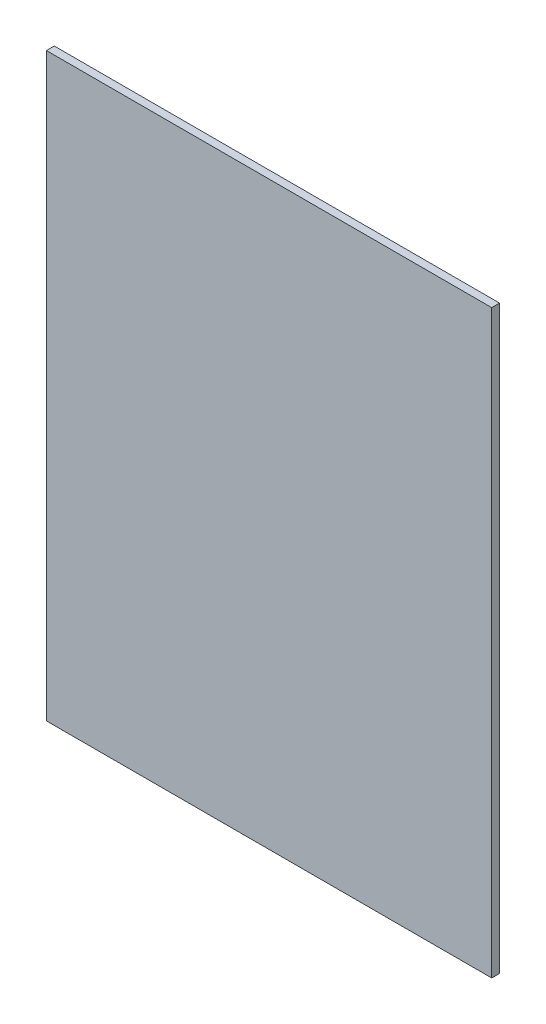
ISO-10303-21;
HEADER;
FILE_DESCRIPTION(('STEP AP214'),'2;1');
FILE_NAME('part.step','',(''),(''),'','','');
FILE_SCHEMA(('AUTOMOTIVE_DESIGN { 1 0 10303 214 1 1 1 1 }'));
ENDSEC;
DATA;
#1=APPLICATION_CONTEXT('core data for automotive mechanical design processes');
#2=APPLICATION_PROTOCOL_DEFINITION('international standard','automotive_design',2000,#1);
#3=PRODUCT_CONTEXT('',#1,'mechanical');
#4=PRODUCT('Part','Part','',(#3));
#5=PRODUCT_RELATED_PRODUCT_CATEGORY('part','',(#4));
#6=PRODUCT_DEFINITION_FORMATION('','',#4);
#7=PRODUCT_DEFINITION_CONTEXT('part definition',#1,'design');
#8=PRODUCT_DEFINITION('design','',#6,#7);
#9=PRODUCT_DEFINITION_SHAPE('','',#8);
#10=(LENGTH_UNIT() NAMED_UNIT(*) SI_UNIT(.MILLI.,.METRE.));
#11=(NAMED_UNIT(*) PLANE_ANGLE_UNIT() SI_UNIT($,.RADIAN.));
#12=(NAMED_UNIT(*) SI_UNIT($,.STERADIAN.) SOLID_ANGLE_UNIT());
#13=UNCERTAINTY_MEASURE_WITH_UNIT(LENGTH_MEASURE(1.E-05),#10,'distance_accuracy_value','');
#14=(GEOMETRIC_REPRESENTATION_CONTEXT(3) GLOBAL_UNCERTAINTY_ASSIGNED_CONTEXT((#13)) GLOBAL_UNIT_ASSIGNED_CONTEXT((#10,
#11,#12)) REPRESENTATION_CONTEXT('',''));
#15=CARTESIAN_POINT('',(0.,0.,0.));
#16=DIRECTION('',(0.,0.,1.));
#17=DIRECTION('',(1.,0.,0.));
#18=AXIS2_PLACEMENT_3D('',#15,#16,#17);
#19=CARTESIAN_POINT('',(180.213,234.95,6.35));
#20=DIRECTION('',(-1.,0.,0.));
#21=DIRECTION('',(0.,-1.,0.));
#22=AXIS2_PLACEMENT_3D('',#19,#20,#21);
#23=PLANE('',#22);
#24=DIRECTION('',(0.,1.,0.));
#25=VECTOR('',#24,1.);
#26=CARTESIAN_POINT('',(180.213,234.95,0.));
#27=LINE('',#26,#25);
#28=CARTESIAN_POINT('',(180.213,-234.95,0.));
#29=VERTEX_POINT('',#28);
#30=CARTESIAN_POINT('',(180.213,234.95,0.));
#31=VERTEX_POINT('',#30);
#32=EDGE_CURVE('E96',#29,#31,#27,.T.);
#33=ORIENTED_EDGE('',*,*,#32,.T.);
#34=DIRECTION('',(0.,0.,-1.));
#35=VECTOR('',#34,1.);
#36=CARTESIAN_POINT('',(180.213,234.95,6.35));
#37=LINE('',#36,#35);
#38=CARTESIAN_POINT('',(180.213,234.95,6.35));
#39=VERTEX_POINT('',#38);
#40=EDGE_CURVE('E11',#39,#31,#37,.T.);
#41=ORIENTED_EDGE('',*,*,#40,.F.);
#42=DIRECTION('',(0.,1.,0.));
#43=VECTOR('',#42,1.);
#44=CARTESIAN_POINT('',(180.213,234.95,6.35));
#45=LINE('',#44,#43);
#46=CARTESIAN_POINT('',(180.213,-234.95,6.35));
#47=VERTEX_POINT('',#46);
#48=EDGE_CURVE('E84',#47,#39,#45,.T.);
#49=ORIENTED_EDGE('',*,*,#48,.F.);
#50=DIRECTION('',(0.,0.,-1.));
#51=VECTOR('',#50,1.);
#52=CARTESIAN_POINT('',(180.213,-234.95,6.35));
#53=LINE('',#52,#51);
#54=EDGE_CURVE('E92',#47,#29,#53,.T.);
#55=ORIENTED_EDGE('',*,*,#54,.T.);
#56=EDGE_LOOP('',(#33,#41,#49,#55));
#57=FACE_BOUND('',#56,.T.);
#58=ADVANCED_FACE('F33',(#57),#23,.F.);
#59=CARTESIAN_POINT('',(-180.213,234.95,6.35));
#60=DIRECTION('',(0.,-1.,0.));
#61=DIRECTION('',(0.,0.,-1.));
#62=AXIS2_PLACEMENT_3D('',#59,#60,#61);
#63=PLANE('',#62);
#64=DIRECTION('',(-1.,0.,0.));
#65=VECTOR('',#64,1.);
#66=CARTESIAN_POINT('',(-180.213,234.95,0.));
#67=LINE('',#66,#65);
#68=CARTESIAN_POINT('',(-180.213,234.95,0.));
#69=VERTEX_POINT('',#68);
#70=EDGE_CURVE('E88',#31,#69,#67,.T.);
#71=ORIENTED_EDGE('',*,*,#70,.T.);
#72=DIRECTION('',(0.,0.,-1.));
#73=VECTOR('',#72,1.);
#74=CARTESIAN_POINT('',(-180.213,234.95,6.35));
#75=LINE('',#74,#73);
#76=CARTESIAN_POINT('',(-180.213,234.95,6.35));
#77=VERTEX_POINT('',#76);
#78=EDGE_CURVE('E41',#77,#69,#75,.T.);
#79=ORIENTED_EDGE('',*,*,#78,.F.);
#80=DIRECTION('',(-1.,0.,0.));
#81=VECTOR('',#80,1.);
#82=CARTESIAN_POINT('',(-180.213,234.95,6.35));
#83=LINE('',#82,#81);
#84=EDGE_CURVE('E79',#39,#77,#83,.T.);
#85=ORIENTED_EDGE('',*,*,#84,.F.);
#86=ORIENTED_EDGE('',*,*,#40,.T.);
#87=EDGE_LOOP('',(#71,#79,#85,#86));
#88=FACE_BOUND('',#87,.T.);
#89=ADVANCED_FACE('F87',(#88),#63,.F.);
#90=CARTESIAN_POINT('',(-180.213,234.95,6.35));
#91=DIRECTION('',(1.,0.,0.));
#92=DIRECTION('',(0.,1.,0.));
#93=AXIS2_PLACEMENT_3D('',#90,#91,#92);
#94=PLANE('',#93);
#95=DIRECTION('',(0.,-1.,0.));
#96=VECTOR('',#95,1.);
#97=CARTESIAN_POINT('',(-180.213,234.95,0.));
#98=LINE('',#97,#96);
#99=CARTESIAN_POINT('',(-180.213,-234.95,0.));
#100=VERTEX_POINT('',#99);
#101=EDGE_CURVE('E66',#69,#100,#98,.T.);
#102=ORIENTED_EDGE('',*,*,#101,.T.);
#103=DIRECTION('',(0.,0.,-1.));
#104=VECTOR('',#103,1.);
#105=CARTESIAN_POINT('',(-180.213,-234.95,6.35));
#106=LINE('',#105,#104);
#107=CARTESIAN_POINT('',(-180.213,-234.95,6.35));
#108=VERTEX_POINT('',#107);
#109=EDGE_CURVE('E89',#108,#100,#106,.T.);
#110=ORIENTED_EDGE('',*,*,#109,.F.);
#111=DIRECTION('',(0.,-1.,0.));
#112=VECTOR('',#111,1.);
#113=CARTESIAN_POINT('',(-180.213,234.95,6.35));
#114=LINE('',#113,#112);
#115=EDGE_CURVE('E82',#77,#108,#114,.T.);
#116=ORIENTED_EDGE('',*,*,#115,.F.);
#117=ORIENTED_EDGE('',*,*,#78,.T.);
#118=EDGE_LOOP('',(#102,#110,#116,#117));
#119=FACE_BOUND('',#118,.T.);
#120=ADVANCED_FACE('F90',(#119),#94,.F.);
#121=CARTESIAN_POINT('',(-180.213,-234.95,6.35));
#122=DIRECTION('',(0.,1.,0.));
#123=DIRECTION('',(0.,0.,1.));
#124=AXIS2_PLACEMENT_3D('',#121,#122,#123);
#125=PLANE('',#124);
#126=DIRECTION('',(1.,0.,0.));
#127=VECTOR('',#126,1.);
#128=CARTESIAN_POINT('',(-180.213,-234.95,0.));
#129=LINE('',#128,#127);
#130=EDGE_CURVE('E72',#100,#29,#129,.T.);
#131=ORIENTED_EDGE('',*,*,#130,.T.);
#132=ORIENTED_EDGE('',*,*,#54,.F.);
#133=DIRECTION('',(1.,0.,0.));
#134=VECTOR('',#133,1.);
#135=CARTESIAN_POINT('',(-180.213,-234.95,6.35));
#136=LINE('',#135,#134);
#137=EDGE_CURVE('E49',#108,#47,#136,.T.);
#138=ORIENTED_EDGE('',*,*,#137,.F.);
#139=ORIENTED_EDGE('',*,*,#109,.T.);
#140=EDGE_LOOP('',(#131,#132,#138,#139));
#141=FACE_BOUND('',#140,.T.);
#142=ADVANCED_FACE('F103',(#141),#125,.F.);
#143=CARTESIAN_POINT('',(0.,0.,6.35));
#144=DIRECTION('',(0.,0.,1.));
#145=DIRECTION('',(1.,0.,0.));
#146=AXIS2_PLACEMENT_3D('',#143,#144,#145);
#147=PLANE('',#146);
#148=ORIENTED_EDGE('',*,*,#48,.T.);
#149=ORIENTED_EDGE('',*,*,#84,.T.);
#150=ORIENTED_EDGE('',*,*,#115,.T.);
#151=ORIENTED_EDGE('',*,*,#137,.T.);
#152=EDGE_LOOP('',(#148,#149,#150,#151));
#153=FACE_BOUND('',#152,.T.);
#154=ADVANCED_FACE('F80',(#153),#147,.T.);
#155=CARTESIAN_POINT('',(0.,0.,0.));
#156=DIRECTION('',(0.,0.,1.));
#157=DIRECTION('',(1.,0.,0.));
#158=AXIS2_PLACEMENT_3D('',#155,#156,#157);
#159=PLANE('',#158);
#160=ORIENTED_EDGE('',*,*,#32,.F.);
#161=ORIENTED_EDGE('',*,*,#130,.F.);
#162=ORIENTED_EDGE('',*,*,#101,.F.);
#163=ORIENTED_EDGE('',*,*,#70,.F.);
#164=EDGE_LOOP('',(#160,#161,#162,#163));
#165=FACE_BOUND('',#164,.T.);
#166=ADVANCED_FACE('F106',(#165),#159,.F.);
#167=CLOSED_SHELL('',(#58,#89,#120,#142,#154,#166));
#168=MANIFOLD_SOLID_BREP('B2',#167);
#169=ADVANCED_BREP_SHAPE_REPRESENTATION('',(#18,#168),#14);
#170=SHAPE_DEFINITION_REPRESENTATION(#9,#169);
ENDSEC;
END-ISO-10303-21;
